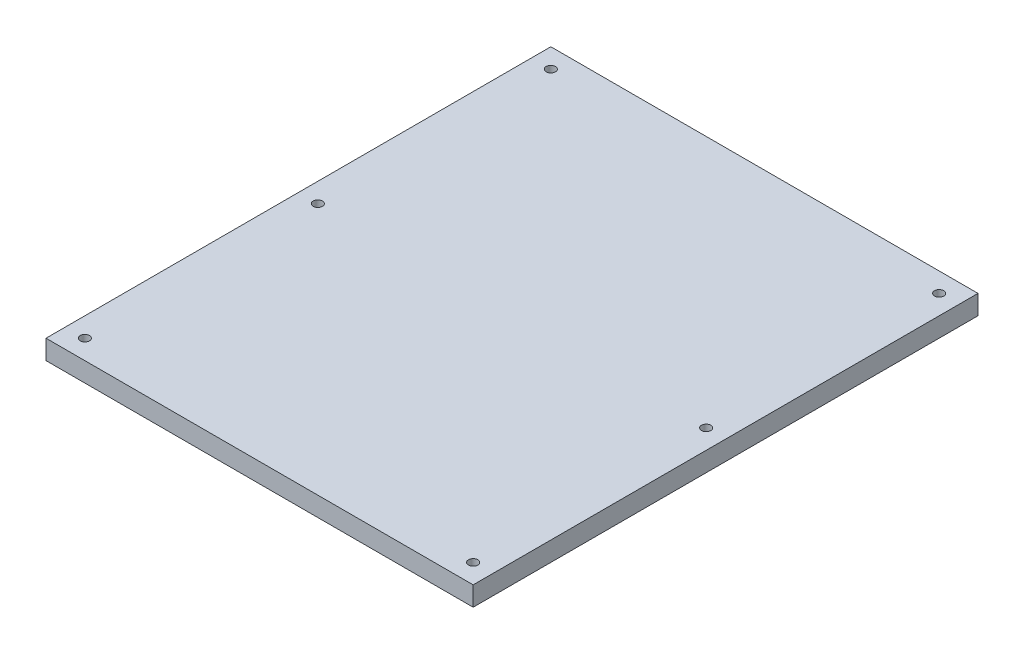
ISO-10303-21;
HEADER;
FILE_DESCRIPTION(('STEP AP214'),'2;1');
FILE_NAME('part.step','',(''),(''),'','','');
FILE_SCHEMA(('AUTOMOTIVE_DESIGN { 1 0 10303 214 1 1 1 1 }'));
ENDSEC;
DATA;
#1=APPLICATION_CONTEXT('core data for automotive mechanical design processes');
#2=APPLICATION_PROTOCOL_DEFINITION('international standard','automotive_design',2000,#1);
#3=PRODUCT_CONTEXT('',#1,'mechanical');
#4=PRODUCT('Part','Part','',(#3));
#5=PRODUCT_RELATED_PRODUCT_CATEGORY('part','',(#4));
#6=PRODUCT_DEFINITION_FORMATION('','',#4);
#7=PRODUCT_DEFINITION_CONTEXT('part definition',#1,'design');
#8=PRODUCT_DEFINITION('design','',#6,#7);
#9=PRODUCT_DEFINITION_SHAPE('','',#8);
#10=(LENGTH_UNIT() NAMED_UNIT(*) SI_UNIT(.MILLI.,.METRE.));
#11=(NAMED_UNIT(*) PLANE_ANGLE_UNIT() SI_UNIT($,.RADIAN.));
#12=(NAMED_UNIT(*) SI_UNIT($,.STERADIAN.) SOLID_ANGLE_UNIT());
#13=UNCERTAINTY_MEASURE_WITH_UNIT(LENGTH_MEASURE(1.E-05),#10,'distance_accuracy_value','');
#14=(GEOMETRIC_REPRESENTATION_CONTEXT(3) GLOBAL_UNCERTAINTY_ASSIGNED_CONTEXT((#13)) GLOBAL_UNIT_ASSIGNED_CONTEXT((#10,
#11,#12)) REPRESENTATION_CONTEXT('',''));
#15=CARTESIAN_POINT('',(0.,0.,0.));
#16=DIRECTION('',(0.,0.,1.));
#17=DIRECTION('',(1.,0.,0.));
#18=AXIS2_PLACEMENT_3D('',#15,#16,#17);
#19=CARTESIAN_POINT('',(-43.4986131353764,6.35,-24.7295322489749));
#20=DIRECTION('',(1.,0.,0.));
#21=DIRECTION('',(0.,0.,-1.));
#22=AXIS2_PLACEMENT_3D('',#19,#20,#21);
#23=PLANE('',#22);
#24=DIRECTION('',(0.,0.,1.));
#25=VECTOR('',#24,1.);
#26=CARTESIAN_POINT('',(-43.4986131353764,0.,-24.7295322489749));
#27=LINE('',#26,#25);
#28=CARTESIAN_POINT('',(-43.4986131353764,0.,-24.7295322489749));
#29=VERTEX_POINT('',#28);
#30=CARTESIAN_POINT('',(-43.4986131353764,0.,140.370467751025));
#31=VERTEX_POINT('',#30);
#32=EDGE_CURVE('E94',#29,#31,#27,.T.);
#33=ORIENTED_EDGE('',*,*,#32,.T.);
#34=DIRECTION('',(0.,-1.,0.));
#35=VECTOR('',#34,1.);
#36=CARTESIAN_POINT('',(-43.4986131353764,6.35,140.370467751025));
#37=LINE('',#36,#35);
#38=CARTESIAN_POINT('',(-43.4986131353764,6.35,140.370467751025));
#39=VERTEX_POINT('',#38);
#40=EDGE_CURVE('E11',#39,#31,#37,.T.);
#41=ORIENTED_EDGE('',*,*,#40,.F.);
#42=DIRECTION('',(0.,0.,1.));
#43=VECTOR('',#42,1.);
#44=CARTESIAN_POINT('',(-43.4986131353764,6.35,-24.7295322489749));
#45=LINE('',#44,#43);
#46=CARTESIAN_POINT('',(-43.4986131353764,6.35,-24.7295322489749));
#47=VERTEX_POINT('',#46);
#48=EDGE_CURVE('E82',#47,#39,#45,.T.);
#49=ORIENTED_EDGE('',*,*,#48,.F.);
#50=DIRECTION('',(0.,-1.,0.));
#51=VECTOR('',#50,1.);
#52=CARTESIAN_POINT('',(-43.4986131353764,6.35,-24.7295322489749));
#53=LINE('',#52,#51);
#54=EDGE_CURVE('E90',#47,#29,#53,.T.);
#55=ORIENTED_EDGE('',*,*,#54,.T.);
#56=EDGE_LOOP('',(#33,#41,#49,#55));
#57=FACE_BOUND('',#56,.T.);
#58=ADVANCED_FACE('F31',(#57),#23,.F.);
#59=CARTESIAN_POINT('',(-43.4986131353764,6.35,140.370467751025));
#60=DIRECTION('',(0.,0.,-1.));
#61=DIRECTION('',(-1.,0.,0.));
#62=AXIS2_PLACEMENT_3D('',#59,#60,#61);
#63=PLANE('',#62);
#64=DIRECTION('',(1.,0.,0.));
#65=VECTOR('',#64,1.);
#66=CARTESIAN_POINT('',(-43.4986131353764,0.,140.370467751025));
#67=LINE('',#66,#65);
#68=CARTESIAN_POINT('',(96.2013868646236,0.,140.370467751025));
#69=VERTEX_POINT('',#68);
#70=EDGE_CURVE('E86',#31,#69,#67,.T.);
#71=ORIENTED_EDGE('',*,*,#70,.T.);
#72=DIRECTION('',(0.,-1.,0.));
#73=VECTOR('',#72,1.);
#74=CARTESIAN_POINT('',(96.2013868646236,6.35,140.370467751025));
#75=LINE('',#74,#73);
#76=CARTESIAN_POINT('',(96.2013868646236,6.35,140.370467751025));
#77=VERTEX_POINT('',#76);
#78=EDGE_CURVE('E39',#77,#69,#75,.T.);
#79=ORIENTED_EDGE('',*,*,#78,.F.);
#80=DIRECTION('',(1.,0.,0.));
#81=VECTOR('',#80,1.);
#82=CARTESIAN_POINT('',(-43.4986131353764,6.35,140.370467751025));
#83=LINE('',#82,#81);
#84=EDGE_CURVE('E77',#39,#77,#83,.T.);
#85=ORIENTED_EDGE('',*,*,#84,.F.);
#86=ORIENTED_EDGE('',*,*,#40,.T.);
#87=EDGE_LOOP('',(#71,#79,#85,#86));
#88=FACE_BOUND('',#87,.T.);
#89=ADVANCED_FACE('F85',(#88),#63,.F.);
#90=CARTESIAN_POINT('',(96.2013868646236,6.35,-24.7295322489749));
#91=DIRECTION('',(-1.,0.,0.));
#92=DIRECTION('',(0.,0.,1.));
#93=AXIS2_PLACEMENT_3D('',#90,#91,#92);
#94=PLANE('',#93);
#95=DIRECTION('',(0.,0.,-1.));
#96=VECTOR('',#95,1.);
#97=CARTESIAN_POINT('',(96.2013868646236,0.,-24.7295322489749));
#98=LINE('',#97,#96);
#99=CARTESIAN_POINT('',(96.2013868646236,0.,-24.7295322489749));
#100=VERTEX_POINT('',#99);
#101=EDGE_CURVE('E64',#69,#100,#98,.T.);
#102=ORIENTED_EDGE('',*,*,#101,.T.);
#103=DIRECTION('',(0.,-1.,0.));
#104=VECTOR('',#103,1.);
#105=CARTESIAN_POINT('',(96.2013868646236,6.35,-24.7295322489749));
#106=LINE('',#105,#104);
#107=CARTESIAN_POINT('',(96.2013868646236,6.35,-24.7295322489749));
#108=VERTEX_POINT('',#107);
#109=EDGE_CURVE('E87',#108,#100,#106,.T.);
#110=ORIENTED_EDGE('',*,*,#109,.F.);
#111=DIRECTION('',(0.,0.,-1.));
#112=VECTOR('',#111,1.);
#113=CARTESIAN_POINT('',(96.2013868646236,6.35,-24.7295322489749));
#114=LINE('',#113,#112);
#115=EDGE_CURVE('E80',#77,#108,#114,.T.);
#116=ORIENTED_EDGE('',*,*,#115,.F.);
#117=ORIENTED_EDGE('',*,*,#78,.T.);
#118=EDGE_LOOP('',(#102,#110,#116,#117));
#119=FACE_BOUND('',#118,.T.);
#120=ADVANCED_FACE('F88',(#119),#94,.F.);
#121=CARTESIAN_POINT('',(-43.4986131353764,6.35,-24.7295322489749));
#122=DIRECTION('',(0.,0.,1.));
#123=DIRECTION('',(1.,0.,0.));
#124=AXIS2_PLACEMENT_3D('',#121,#122,#123);
#125=PLANE('',#124);
#126=DIRECTION('',(-1.,0.,0.));
#127=VECTOR('',#126,1.);
#128=CARTESIAN_POINT('',(-43.4986131353764,0.,-24.7295322489749));
#129=LINE('',#128,#127);
#130=EDGE_CURVE('E70',#100,#29,#129,.T.);
#131=ORIENTED_EDGE('',*,*,#130,.T.);
#132=ORIENTED_EDGE('',*,*,#54,.F.);
#133=DIRECTION('',(-1.,0.,0.));
#134=VECTOR('',#133,1.);
#135=CARTESIAN_POINT('',(-43.4986131353764,6.35,-24.7295322489749));
#136=LINE('',#135,#134);
#137=EDGE_CURVE('E47',#108,#47,#136,.T.);
#138=ORIENTED_EDGE('',*,*,#137,.F.);
#139=ORIENTED_EDGE('',*,*,#109,.T.);
#140=EDGE_LOOP('',(#131,#132,#138,#139));
#141=FACE_BOUND('',#140,.T.);
#142=ADVANCED_FACE('F102',(#141),#125,.F.);
#143=CARTESIAN_POINT('',(-43.4986131353764,6.35,140.370467751025));
#144=DIRECTION('',(0.,1.,0.));
#145=DIRECTION('',(0.,0.,1.));
#146=AXIS2_PLACEMENT_3D('',#143,#144,#145);
#147=PLANE('',#146);
#148=CARTESIAN_POINT('',(-37.1486131353764,6.35,134.020467751025));
#149=DIRECTION('',(0.,1.,0.));
#150=DIRECTION('',(0.,0.,1.));
#151=AXIS2_PLACEMENT_3D('',#148,#149,#150);
#152=CIRCLE('',#151,1.524);
#153=CARTESIAN_POINT('',(-37.1486131353764,6.35,135.544467751025));
#154=VERTEX_POINT('',#153);
#155=EDGE_CURVE('E138',#154,#154,#152,.T.);
#156=ORIENTED_EDGE('',*,*,#155,.F.);
#157=EDGE_LOOP('',(#156));
#158=FACE_BOUND('',#157,.T.);
#159=CARTESIAN_POINT('',(89.8513868646236,6.35,57.8204677510251));
#160=DIRECTION('',(0.,1.,0.));
#161=DIRECTION('',(0.,0.,1.));
#162=AXIS2_PLACEMENT_3D('',#159,#160,#161);
#163=CIRCLE('',#162,1.52399999999999);
#164=CARTESIAN_POINT('',(89.8513868646236,6.35,59.3444677510251));
#165=VERTEX_POINT('',#164);
#166=EDGE_CURVE('E132',#165,#165,#163,.T.);
#167=ORIENTED_EDGE('',*,*,#166,.F.);
#168=EDGE_LOOP('',(#167));
#169=FACE_BOUND('',#168,.T.);
#170=CARTESIAN_POINT('',(89.8513868646236,6.35,134.020467751025));
#171=DIRECTION('',(0.,1.,0.));
#172=DIRECTION('',(0.,0.,1.));
#173=AXIS2_PLACEMENT_3D('',#170,#171,#172);
#174=CIRCLE('',#173,1.52399999999999);
#175=CARTESIAN_POINT('',(89.8513868646236,6.35,135.544467751025));
#176=VERTEX_POINT('',#175);
#177=EDGE_CURVE('E126',#176,#176,#174,.T.);
#178=ORIENTED_EDGE('',*,*,#177,.F.);
#179=EDGE_LOOP('',(#178));
#180=FACE_BOUND('',#179,.T.);
#181=CARTESIAN_POINT('',(89.8513868646236,6.35,-18.3795322489749));
#182=DIRECTION('',(0.,1.,0.));
#183=DIRECTION('',(0.,0.,1.));
#184=AXIS2_PLACEMENT_3D('',#181,#182,#183);
#185=CIRCLE('',#184,1.52399999999999);
#186=CARTESIAN_POINT('',(89.8513868646236,6.35,-16.8555322489749));
#187=VERTEX_POINT('',#186);
#188=EDGE_CURVE('E120',#187,#187,#185,.T.);
#189=ORIENTED_EDGE('',*,*,#188,.F.);
#190=EDGE_LOOP('',(#189));
#191=FACE_BOUND('',#190,.T.);
#192=CARTESIAN_POINT('',(-37.1486131353764,6.35,57.8204677510251));
#193=DIRECTION('',(0.,1.,0.));
#194=DIRECTION('',(0.,0.,1.));
#195=AXIS2_PLACEMENT_3D('',#192,#193,#194);
#196=CIRCLE('',#195,1.524);
#197=CARTESIAN_POINT('',(-37.1486131353764,6.35,59.3444677510251));
#198=VERTEX_POINT('',#197);
#199=EDGE_CURVE('E114',#198,#198,#196,.T.);
#200=ORIENTED_EDGE('',*,*,#199,.F.);
#201=EDGE_LOOP('',(#200));
#202=FACE_BOUND('',#201,.T.);
#203=CARTESIAN_POINT('',(-37.1486131353764,6.35,-18.3795322489749));
#204=DIRECTION('',(0.,1.,0.));
#205=DIRECTION('',(0.,0.,1.));
#206=AXIS2_PLACEMENT_3D('',#203,#204,#205);
#207=CIRCLE('',#206,1.524);
#208=CARTESIAN_POINT('',(-37.1486131353764,6.35,-16.8555322489749));
#209=VERTEX_POINT('',#208);
#210=EDGE_CURVE('E108',#209,#209,#207,.T.);
#211=ORIENTED_EDGE('',*,*,#210,.F.);
#212=EDGE_LOOP('',(#211));
#213=FACE_BOUND('',#212,.T.);
#214=ORIENTED_EDGE('',*,*,#48,.T.);
#215=ORIENTED_EDGE('',*,*,#84,.T.);
#216=ORIENTED_EDGE('',*,*,#115,.T.);
#217=ORIENTED_EDGE('',*,*,#137,.T.);
#218=EDGE_LOOP('',(#214,#215,#216,#217));
#219=FACE_BOUND('',#218,.T.);
#220=ADVANCED_FACE('F78',(#158,#169,#180,#191,#202,#213,#219),#147,.T.);
#221=CARTESIAN_POINT('',(-43.4986131353764,0.,140.370467751025));
#222=DIRECTION('',(0.,1.,0.));
#223=DIRECTION('',(0.,0.,1.));
#224=AXIS2_PLACEMENT_3D('',#221,#222,#223);
#225=PLANE('',#224);
#226=CARTESIAN_POINT('',(-37.1486131353764,0.,134.020467751025));
#227=DIRECTION('',(0.,1.,0.));
#228=DIRECTION('',(0.,0.,1.));
#229=AXIS2_PLACEMENT_3D('',#226,#227,#228);
#230=CIRCLE('',#229,1.524);
#231=CARTESIAN_POINT('',(-37.1486131353764,0.,135.544467751025));
#232=VERTEX_POINT('',#231);
#233=EDGE_CURVE('E135',#232,#232,#230,.T.);
#234=ORIENTED_EDGE('',*,*,#233,.T.);
#235=EDGE_LOOP('',(#234));
#236=FACE_BOUND('',#235,.T.);
#237=CARTESIAN_POINT('',(89.8513868646236,0.,57.8204677510251));
#238=DIRECTION('',(0.,1.,0.));
#239=DIRECTION('',(0.,0.,1.));
#240=AXIS2_PLACEMENT_3D('',#237,#238,#239);
#241=CIRCLE('',#240,1.52399999999999);
#242=CARTESIAN_POINT('',(89.8513868646236,0.,59.3444677510251));
#243=VERTEX_POINT('',#242);
#244=EDGE_CURVE('E129',#243,#243,#241,.T.);
#245=ORIENTED_EDGE('',*,*,#244,.T.);
#246=EDGE_LOOP('',(#245));
#247=FACE_BOUND('',#246,.T.);
#248=CARTESIAN_POINT('',(89.8513868646236,0.,134.020467751025));
#249=DIRECTION('',(0.,1.,0.));
#250=DIRECTION('',(0.,0.,1.));
#251=AXIS2_PLACEMENT_3D('',#248,#249,#250);
#252=CIRCLE('',#251,1.52399999999999);
#253=CARTESIAN_POINT('',(89.8513868646236,0.,135.544467751025));
#254=VERTEX_POINT('',#253);
#255=EDGE_CURVE('E123',#254,#254,#252,.T.);
#256=ORIENTED_EDGE('',*,*,#255,.T.);
#257=EDGE_LOOP('',(#256));
#258=FACE_BOUND('',#257,.T.);
#259=CARTESIAN_POINT('',(89.8513868646236,0.,-18.3795322489749));
#260=DIRECTION('',(0.,1.,0.));
#261=DIRECTION('',(0.,0.,1.));
#262=AXIS2_PLACEMENT_3D('',#259,#260,#261);
#263=CIRCLE('',#262,1.52399999999999);
#264=CARTESIAN_POINT('',(89.8513868646236,0.,-16.8555322489749));
#265=VERTEX_POINT('',#264);
#266=EDGE_CURVE('E117',#265,#265,#263,.T.);
#267=ORIENTED_EDGE('',*,*,#266,.T.);
#268=EDGE_LOOP('',(#267));
#269=FACE_BOUND('',#268,.T.);
#270=CARTESIAN_POINT('',(-37.1486131353764,0.,57.8204677510251));
#271=DIRECTION('',(0.,1.,0.));
#272=DIRECTION('',(0.,0.,1.));
#273=AXIS2_PLACEMENT_3D('',#270,#271,#272);
#274=CIRCLE('',#273,1.524);
#275=CARTESIAN_POINT('',(-37.1486131353764,0.,59.3444677510251));
#276=VERTEX_POINT('',#275);
#277=EDGE_CURVE('E111',#276,#276,#274,.T.);
#278=ORIENTED_EDGE('',*,*,#277,.T.);
#279=EDGE_LOOP('',(#278));
#280=FACE_BOUND('',#279,.T.);
#281=CARTESIAN_POINT('',(-37.1486131353764,0.,-18.3795322489749));
#282=DIRECTION('',(0.,1.,0.));
#283=DIRECTION('',(0.,0.,1.));
#284=AXIS2_PLACEMENT_3D('',#281,#282,#283);
#285=CIRCLE('',#284,1.524);
#286=CARTESIAN_POINT('',(-37.1486131353764,0.,-16.8555322489749));
#287=VERTEX_POINT('',#286);
#288=EDGE_CURVE('E97',#287,#287,#285,.T.);
#289=ORIENTED_EDGE('',*,*,#288,.T.);
#290=EDGE_LOOP('',(#289));
#291=FACE_BOUND('',#290,.T.);
#292=ORIENTED_EDGE('',*,*,#32,.F.);
#293=ORIENTED_EDGE('',*,*,#130,.F.);
#294=ORIENTED_EDGE('',*,*,#101,.F.);
#295=ORIENTED_EDGE('',*,*,#70,.F.);
#296=EDGE_LOOP('',(#292,#293,#294,#295));
#297=FACE_BOUND('',#296,.T.);
#298=ADVANCED_FACE('F105',(#236,#247,#258,#269,#280,#291,#297),#225,.F.);
#299=CARTESIAN_POINT('',(-37.1486131353764,0.,-18.3795322489749));
#300=DIRECTION('',(0.,1.,0.));
#301=DIRECTION('',(0.,0.,1.));
#302=AXIS2_PLACEMENT_3D('',#299,#300,#301);
#303=CYLINDRICAL_SURFACE('',#302,1.524);
#304=ORIENTED_EDGE('',*,*,#288,.F.);
#305=EDGE_LOOP('',(#304));
#306=FACE_BOUND('',#305,.T.);
#307=ORIENTED_EDGE('',*,*,#210,.T.);
#308=EDGE_LOOP('',(#307));
#309=FACE_BOUND('',#308,.T.);
#310=ADVANCED_FACE('F166',(#306,#309),#303,.F.);
#311=CARTESIAN_POINT('',(-37.1486131353764,0.,57.8204677510251));
#312=DIRECTION('',(0.,1.,0.));
#313=DIRECTION('',(0.,0.,1.));
#314=AXIS2_PLACEMENT_3D('',#311,#312,#313);
#315=CYLINDRICAL_SURFACE('',#314,1.524);
#316=ORIENTED_EDGE('',*,*,#277,.F.);
#317=EDGE_LOOP('',(#316));
#318=FACE_BOUND('',#317,.T.);
#319=ORIENTED_EDGE('',*,*,#199,.T.);
#320=EDGE_LOOP('',(#319));
#321=FACE_BOUND('',#320,.T.);
#322=ADVANCED_FACE('F168',(#318,#321),#315,.F.);
#323=CARTESIAN_POINT('',(89.8513868646236,0.,-18.3795322489749));
#324=DIRECTION('',(0.,1.,0.));
#325=DIRECTION('',(0.,0.,1.));
#326=AXIS2_PLACEMENT_3D('',#323,#324,#325);
#327=CYLINDRICAL_SURFACE('',#326,1.52399999999999);
#328=ORIENTED_EDGE('',*,*,#266,.F.);
#329=EDGE_LOOP('',(#328));
#330=FACE_BOUND('',#329,.T.);
#331=ORIENTED_EDGE('',*,*,#188,.T.);
#332=EDGE_LOOP('',(#331));
#333=FACE_BOUND('',#332,.T.);
#334=ADVANCED_FACE('F175',(#330,#333),#327,.F.);
#335=CARTESIAN_POINT('',(89.8513868646236,0.,134.020467751025));
#336=DIRECTION('',(0.,1.,0.));
#337=DIRECTION('',(0.,0.,1.));
#338=AXIS2_PLACEMENT_3D('',#335,#336,#337);
#339=CYLINDRICAL_SURFACE('',#338,1.52399999999999);
#340=ORIENTED_EDGE('',*,*,#255,.F.);
#341=EDGE_LOOP('',(#340));
#342=FACE_BOUND('',#341,.T.);
#343=ORIENTED_EDGE('',*,*,#177,.T.);
#344=EDGE_LOOP('',(#343));
#345=FACE_BOUND('',#344,.T.);
#346=ADVANCED_FACE('F221',(#342,#345),#339,.F.);
#347=CARTESIAN_POINT('',(89.8513868646236,0.,57.8204677510251));
#348=DIRECTION('',(0.,1.,0.));
#349=DIRECTION('',(0.,0.,1.));
#350=AXIS2_PLACEMENT_3D('',#347,#348,#349);
#351=CYLINDRICAL_SURFACE('',#350,1.52399999999999);
#352=ORIENTED_EDGE('',*,*,#244,.F.);
#353=EDGE_LOOP('',(#352));
#354=FACE_BOUND('',#353,.T.);
#355=ORIENTED_EDGE('',*,*,#166,.T.);
#356=EDGE_LOOP('',(#355));
#357=FACE_BOUND('',#356,.T.);
#358=ADVANCED_FACE('F149',(#354,#357),#351,.F.);
#359=CARTESIAN_POINT('',(-37.1486131353764,0.,134.020467751025));
#360=DIRECTION('',(0.,1.,0.));
#361=DIRECTION('',(0.,0.,1.));
#362=AXIS2_PLACEMENT_3D('',#359,#360,#361);
#363=CYLINDRICAL_SURFACE('',#362,1.524);
#364=ORIENTED_EDGE('',*,*,#233,.F.);
#365=EDGE_LOOP('',(#364));
#366=FACE_BOUND('',#365,.T.);
#367=ORIENTED_EDGE('',*,*,#155,.T.);
#368=EDGE_LOOP('',(#367));
#369=FACE_BOUND('',#368,.T.);
#370=ADVANCED_FACE('F146',(#366,#369),#363,.F.);
#371=CLOSED_SHELL('',(#58,#89,#120,#142,#220,#298,#310,#322,#334,#346,#358,#370));
#372=MANIFOLD_SOLID_BREP('B2',#371);
#373=ADVANCED_BREP_SHAPE_REPRESENTATION('',(#18,#372),#14);
#374=SHAPE_DEFINITION_REPRESENTATION(#9,#373);
ENDSEC;
END-ISO-10303-21;
